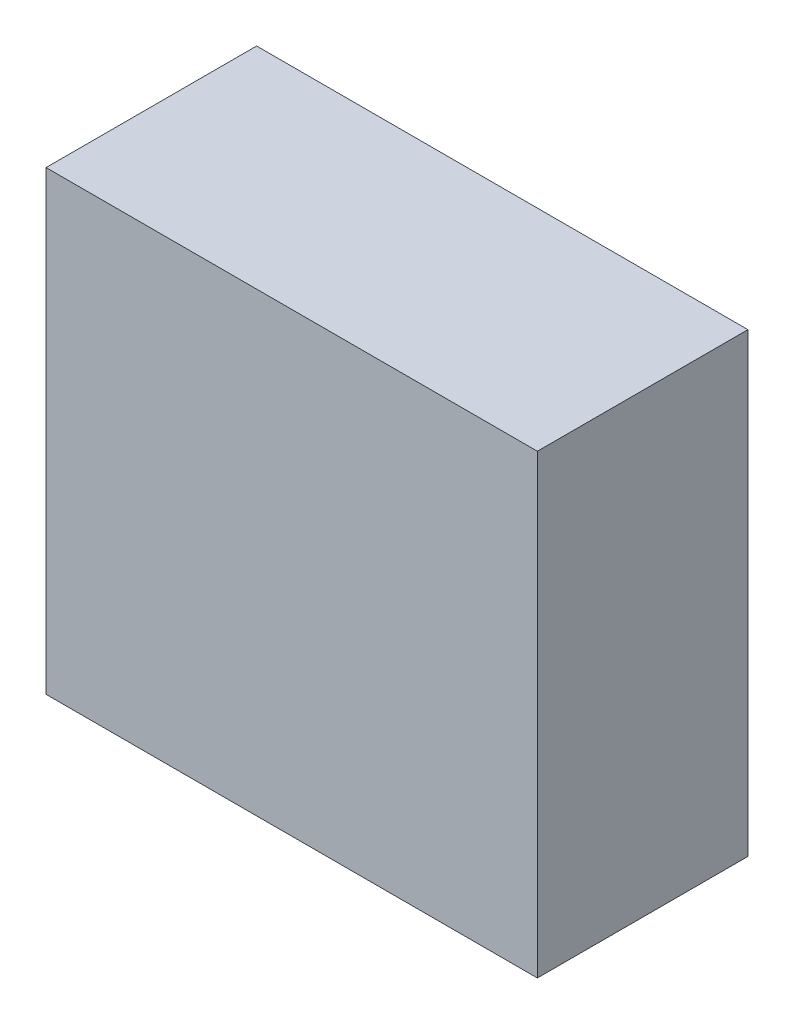
ISO-10303-21;
HEADER;
FILE_DESCRIPTION(('STEP AP214'),'2;1');
FILE_NAME('part.step','',(''),(''),'','','');
FILE_SCHEMA(('AUTOMOTIVE_DESIGN { 1 0 10303 214 1 1 1 1 }'));
ENDSEC;
DATA;
#1=APPLICATION_CONTEXT('core data for automotive mechanical design processes');
#2=APPLICATION_PROTOCOL_DEFINITION('international standard','automotive_design',2000,#1);
#3=PRODUCT_CONTEXT('',#1,'mechanical');
#4=PRODUCT('Part','Part','',(#3));
#5=PRODUCT_RELATED_PRODUCT_CATEGORY('part','',(#4));
#6=PRODUCT_DEFINITION_FORMATION('','',#4);
#7=PRODUCT_DEFINITION_CONTEXT('part definition',#1,'design');
#8=PRODUCT_DEFINITION('design','',#6,#7);
#9=PRODUCT_DEFINITION_SHAPE('','',#8);
#10=(LENGTH_UNIT() NAMED_UNIT(*) SI_UNIT(.MILLI.,.METRE.));
#11=(NAMED_UNIT(*) PLANE_ANGLE_UNIT() SI_UNIT($,.RADIAN.));
#12=(NAMED_UNIT(*) SI_UNIT($,.STERADIAN.) SOLID_ANGLE_UNIT());
#13=UNCERTAINTY_MEASURE_WITH_UNIT(LENGTH_MEASURE(1.E-05),#10,'distance_accuracy_value','');
#14=(GEOMETRIC_REPRESENTATION_CONTEXT(3) GLOBAL_UNCERTAINTY_ASSIGNED_CONTEXT((#13)) GLOBAL_UNIT_ASSIGNED_CONTEXT((#10,
#11,#12)) REPRESENTATION_CONTEXT('',''));
#15=CARTESIAN_POINT('',(0.,0.,0.));
#16=DIRECTION('',(0.,0.,1.));
#17=DIRECTION('',(1.,0.,0.));
#18=AXIS2_PLACEMENT_3D('',#15,#16,#17);
#19=CARTESIAN_POINT('',(88.9,82.55,38.1));
#20=DIRECTION('',(-1.,0.,0.));
#21=DIRECTION('',(0.,0.,1.));
#22=AXIS2_PLACEMENT_3D('',#19,#20,#21);
#23=PLANE('',#22);
#24=DIRECTION('',(0.,0.,-1.));
#25=VECTOR('',#24,1.);
#26=CARTESIAN_POINT('',(88.9,-82.55,38.1));
#27=LINE('',#26,#25);
#28=CARTESIAN_POINT('',(88.9,-82.55,38.1));
#29=VERTEX_POINT('',#28);
#30=CARTESIAN_POINT('',(88.9,-82.55,-38.1));
#31=VERTEX_POINT('',#30);
#32=EDGE_CURVE('E104',#29,#31,#27,.T.);
#33=ORIENTED_EDGE('',*,*,#32,.T.);
#34=DIRECTION('',(0.,-1.,0.));
#35=VECTOR('',#34,1.);
#36=CARTESIAN_POINT('',(88.9,82.55,-38.1));
#37=LINE('',#36,#35);
#38=CARTESIAN_POINT('',(88.9,82.55,-38.1));
#39=VERTEX_POINT('',#38);
#40=EDGE_CURVE('E11',#39,#31,#37,.T.);
#41=ORIENTED_EDGE('',*,*,#40,.F.);
#42=DIRECTION('',(0.,0.,-1.));
#43=VECTOR('',#42,1.);
#44=CARTESIAN_POINT('',(88.9,82.55,38.1));
#45=LINE('',#44,#43);
#46=CARTESIAN_POINT('',(88.9,82.55,38.1));
#47=VERTEX_POINT('',#46);
#48=EDGE_CURVE('E92',#47,#39,#45,.T.);
#49=ORIENTED_EDGE('',*,*,#48,.F.);
#50=DIRECTION('',(0.,-1.,0.));
#51=VECTOR('',#50,1.);
#52=CARTESIAN_POINT('',(88.9,82.55,38.1));
#53=LINE('',#52,#51);
#54=EDGE_CURVE('E100',#47,#29,#53,.T.);
#55=ORIENTED_EDGE('',*,*,#54,.T.);
#56=EDGE_LOOP('',(#33,#41,#49,#55));
#57=FACE_BOUND('',#56,.T.);
#58=ADVANCED_FACE('F41',(#57),#23,.F.);
#59=CARTESIAN_POINT('',(-88.9,82.55,-38.1));
#60=DIRECTION('',(0.,0.,1.));
#61=DIRECTION('',(1.,0.,0.));
#62=AXIS2_PLACEMENT_3D('',#59,#60,#61);
#63=PLANE('',#62);
#64=DIRECTION('',(-1.,0.,0.));
#65=VECTOR('',#64,1.);
#66=CARTESIAN_POINT('',(-88.9,-82.55,-38.1));
#67=LINE('',#66,#65);
#68=CARTESIAN_POINT('',(-88.9,-82.55,-38.1));
#69=VERTEX_POINT('',#68);
#70=EDGE_CURVE('E96',#31,#69,#67,.T.);
#71=ORIENTED_EDGE('',*,*,#70,.T.);
#72=DIRECTION('',(0.,-1.,0.));
#73=VECTOR('',#72,1.);
#74=CARTESIAN_POINT('',(-88.9,82.55,-38.1));
#75=LINE('',#74,#73);
#76=CARTESIAN_POINT('',(-88.9,82.55,-38.1));
#77=VERTEX_POINT('',#76);
#78=EDGE_CURVE('E49',#77,#69,#75,.T.);
#79=ORIENTED_EDGE('',*,*,#78,.F.);
#80=DIRECTION('',(-1.,0.,0.));
#81=VECTOR('',#80,1.);
#82=CARTESIAN_POINT('',(-88.9,82.55,-38.1));
#83=LINE('',#82,#81);
#84=EDGE_CURVE('E87',#39,#77,#83,.T.);
#85=ORIENTED_EDGE('',*,*,#84,.F.);
#86=ORIENTED_EDGE('',*,*,#40,.T.);
#87=EDGE_LOOP('',(#71,#79,#85,#86));
#88=FACE_BOUND('',#87,.T.);
#89=ADVANCED_FACE('F95',(#88),#63,.F.);
#90=CARTESIAN_POINT('',(-88.9,82.55,38.1));
#91=DIRECTION('',(1.,0.,0.));
#92=DIRECTION('',(0.,0.,-1.));
#93=AXIS2_PLACEMENT_3D('',#90,#91,#92);
#94=PLANE('',#93);
#95=DIRECTION('',(0.,0.,1.));
#96=VECTOR('',#95,1.);
#97=CARTESIAN_POINT('',(-88.9,-82.55,38.1));
#98=LINE('',#97,#96);
#99=CARTESIAN_POINT('',(-88.9,-82.55,38.1));
#100=VERTEX_POINT('',#99);
#101=EDGE_CURVE('E74',#69,#100,#98,.T.);
#102=ORIENTED_EDGE('',*,*,#101,.T.);
#103=DIRECTION('',(0.,-1.,0.));
#104=VECTOR('',#103,1.);
#105=CARTESIAN_POINT('',(-88.9,82.55,38.1));
#106=LINE('',#105,#104);
#107=CARTESIAN_POINT('',(-88.9,82.55,38.1));
#108=VERTEX_POINT('',#107);
#109=EDGE_CURVE('E97',#108,#100,#106,.T.);
#110=ORIENTED_EDGE('',*,*,#109,.F.);
#111=DIRECTION('',(0.,0.,1.));
#112=VECTOR('',#111,1.);
#113=CARTESIAN_POINT('',(-88.9,82.55,38.1));
#114=LINE('',#113,#112);
#115=EDGE_CURVE('E90',#77,#108,#114,.T.);
#116=ORIENTED_EDGE('',*,*,#115,.F.);
#117=ORIENTED_EDGE('',*,*,#78,.T.);
#118=EDGE_LOOP('',(#102,#110,#116,#117));
#119=FACE_BOUND('',#118,.T.);
#120=ADVANCED_FACE('F98',(#119),#94,.F.);
#121=CARTESIAN_POINT('',(-88.9,82.55,38.1));
#122=DIRECTION('',(0.,0.,-1.));
#123=DIRECTION('',(-1.,0.,0.));
#124=AXIS2_PLACEMENT_3D('',#121,#122,#123);
#125=PLANE('',#124);
#126=DIRECTION('',(1.,0.,0.));
#127=VECTOR('',#126,1.);
#128=CARTESIAN_POINT('',(-88.9,-82.55,38.1));
#129=LINE('',#128,#127);
#130=EDGE_CURVE('E80',#100,#29,#129,.T.);
#131=ORIENTED_EDGE('',*,*,#130,.T.);
#132=ORIENTED_EDGE('',*,*,#54,.F.);
#133=DIRECTION('',(1.,0.,0.));
#134=VECTOR('',#133,1.);
#135=CARTESIAN_POINT('',(-88.9,82.55,38.1));
#136=LINE('',#135,#134);
#137=EDGE_CURVE('E57',#108,#47,#136,.T.);
#138=ORIENTED_EDGE('',*,*,#137,.F.);
#139=ORIENTED_EDGE('',*,*,#109,.T.);
#140=EDGE_LOOP('',(#131,#132,#138,#139));
#141=FACE_BOUND('',#140,.T.);
#142=ADVANCED_FACE('F111',(#141),#125,.F.);
#143=CARTESIAN_POINT('',(0.,82.55,0.));
#144=DIRECTION('',(0.,-1.,0.));
#145=DIRECTION('',(0.,0.,-1.));
#146=AXIS2_PLACEMENT_3D('',#143,#144,#145);
#147=PLANE('',#146);
#148=ORIENTED_EDGE('',*,*,#48,.T.);
#149=ORIENTED_EDGE('',*,*,#84,.T.);
#150=ORIENTED_EDGE('',*,*,#115,.T.);
#151=ORIENTED_EDGE('',*,*,#137,.T.);
#152=EDGE_LOOP('',(#148,#149,#150,#151));
#153=FACE_BOUND('',#152,.T.);
#154=ADVANCED_FACE('F88',(#153),#147,.F.);
#155=CARTESIAN_POINT('',(0.,-82.55,0.));
#156=DIRECTION('',(0.,-1.,0.));
#157=DIRECTION('',(0.,0.,-1.));
#158=AXIS2_PLACEMENT_3D('',#155,#156,#157);
#159=PLANE('',#158);
#160=ORIENTED_EDGE('',*,*,#32,.F.);
#161=ORIENTED_EDGE('',*,*,#130,.F.);
#162=ORIENTED_EDGE('',*,*,#101,.F.);
#163=ORIENTED_EDGE('',*,*,#70,.F.);
#164=EDGE_LOOP('',(#160,#161,#162,#163));
#165=FACE_BOUND('',#164,.T.);
#166=ADVANCED_FACE('F114',(#165),#159,.T.);
#167=CLOSED_SHELL('',(#58,#89,#120,#142,#154,#166));
#168=MANIFOLD_SOLID_BREP('B2',#167);
#169=ADVANCED_BREP_SHAPE_REPRESENTATION('',(#18,#168),#14);
#170=SHAPE_DEFINITION_REPRESENTATION(#9,#169);
ENDSEC;
END-ISO-10303-21;
